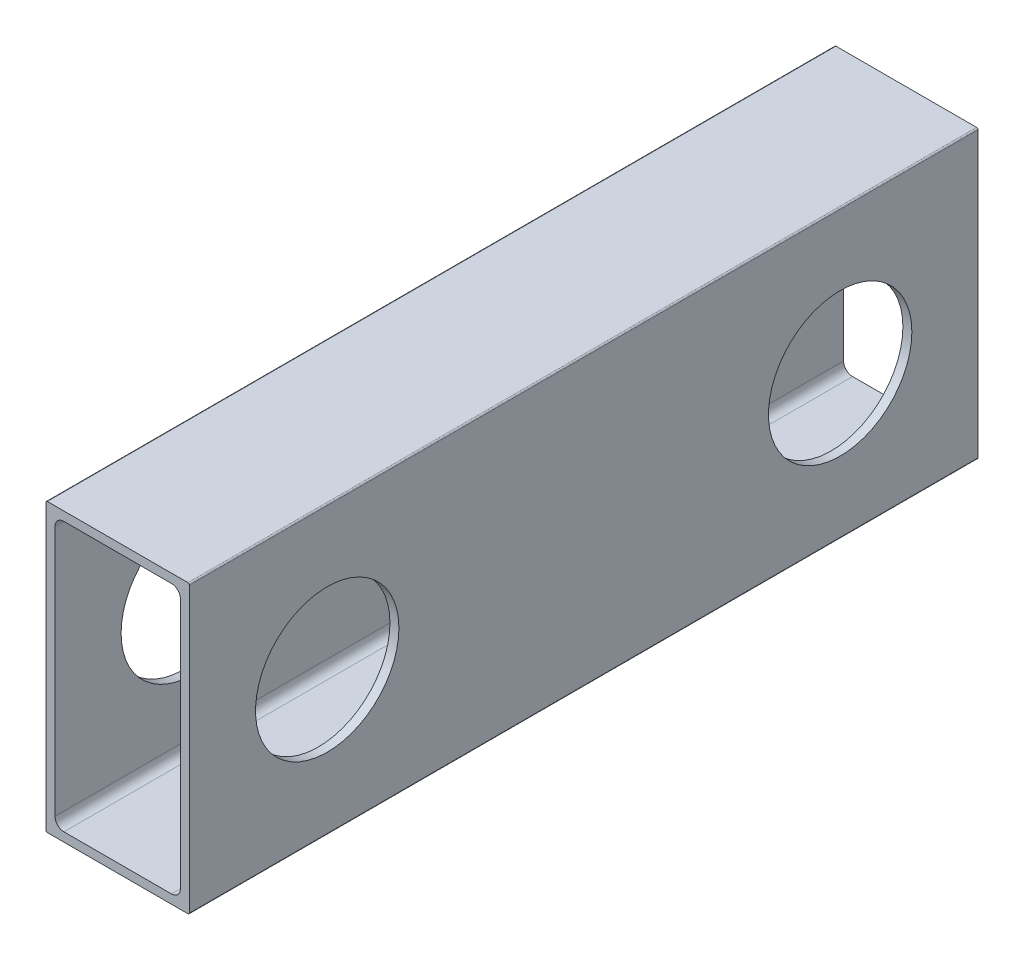
ISO-10303-21;
HEADER;
FILE_DESCRIPTION(('STEP AP214'),'2;1');
FILE_NAME('part.step','',(''),(''),'','','');
FILE_SCHEMA(('AUTOMOTIVE_DESIGN { 1 0 10303 214 1 1 1 1 }'));
ENDSEC;
DATA;
#1=APPLICATION_CONTEXT('core data for automotive mechanical design processes');
#2=APPLICATION_PROTOCOL_DEFINITION('international standard','automotive_design',2000,#1);
#3=PRODUCT_CONTEXT('',#1,'mechanical');
#4=PRODUCT('Part','Part','',(#3));
#5=PRODUCT_RELATED_PRODUCT_CATEGORY('part','',(#4));
#6=PRODUCT_DEFINITION_FORMATION('','',#4);
#7=PRODUCT_DEFINITION_CONTEXT('part definition',#1,'design');
#8=PRODUCT_DEFINITION('design','',#6,#7);
#9=PRODUCT_DEFINITION_SHAPE('','',#8);
#10=(LENGTH_UNIT() NAMED_UNIT(*) SI_UNIT(.MILLI.,.METRE.));
#11=(NAMED_UNIT(*) PLANE_ANGLE_UNIT() SI_UNIT($,.RADIAN.));
#12=(NAMED_UNIT(*) SI_UNIT($,.STERADIAN.) SOLID_ANGLE_UNIT());
#13=UNCERTAINTY_MEASURE_WITH_UNIT(LENGTH_MEASURE(1.E-05),#10,'distance_accuracy_value','');
#14=(GEOMETRIC_REPRESENTATION_CONTEXT(3) GLOBAL_UNCERTAINTY_ASSIGNED_CONTEXT((#13)) GLOBAL_UNIT_ASSIGNED_CONTEXT((#10,
#11,#12)) REPRESENTATION_CONTEXT('',''));
#15=CARTESIAN_POINT('',(0.,0.,0.));
#16=DIRECTION('',(0.,0.,1.));
#17=DIRECTION('',(1.,0.,0.));
#18=AXIS2_PLACEMENT_3D('',#15,#16,#17);
#19=CARTESIAN_POINT('',(12.446,25.146,139.7));
#20=DIRECTION('',(0.,0.,-1.));
#21=DIRECTION('',(-1.,0.,0.));
#22=AXIS2_PLACEMENT_3D('',#19,#20,#21);
#23=CYLINDRICAL_SURFACE('',#22,0.253999999999998);
#24=CARTESIAN_POINT('',(12.446,25.146,0.));
#25=DIRECTION('',(0.,0.,-1.));
#26=DIRECTION('',(-1.,0.,0.));
#27=AXIS2_PLACEMENT_3D('',#24,#25,#26);
#28=CIRCLE('',#27,0.253999999999998);
#29=CARTESIAN_POINT('',(12.446,25.4,0.));
#30=VERTEX_POINT('',#29);
#31=CARTESIAN_POINT('',(12.7,25.146,0.));
#32=VERTEX_POINT('',#31);
#33=EDGE_CURVE('E206',#30,#32,#28,.T.);
#34=ORIENTED_EDGE('',*,*,#33,.F.);
#35=DIRECTION('',(0.,0.,-1.));
#36=VECTOR('',#35,1.);
#37=CARTESIAN_POINT('',(12.446,25.4,139.7));
#38=LINE('',#37,#36);
#39=CARTESIAN_POINT('',(12.446,25.4,139.7));
#40=VERTEX_POINT('',#39);
#41=EDGE_CURVE('E11',#40,#30,#38,.T.);
#42=ORIENTED_EDGE('',*,*,#41,.F.);
#43=CARTESIAN_POINT('',(12.446,25.146,139.7));
#44=DIRECTION('',(0.,0.,-1.));
#45=DIRECTION('',(-1.,0.,0.));
#46=AXIS2_PLACEMENT_3D('',#43,#44,#45);
#47=CIRCLE('',#46,0.253999999999998);
#48=CARTESIAN_POINT('',(12.7,25.146,139.7));
#49=VERTEX_POINT('',#48);
#50=EDGE_CURVE('E218',#40,#49,#47,.T.);
#51=ORIENTED_EDGE('',*,*,#50,.T.);
#52=DIRECTION('',(0.,0.,-1.));
#53=VECTOR('',#52,1.);
#54=CARTESIAN_POINT('',(12.7,25.146,139.7));
#55=LINE('',#54,#53);
#56=EDGE_CURVE('E243',#49,#32,#55,.T.);
#57=ORIENTED_EDGE('',*,*,#56,.T.);
#58=EDGE_LOOP('',(#34,#42,#51,#57));
#59=FACE_BOUND('',#58,.T.);
#60=ADVANCED_FACE('F33',(#59),#23,.T.);
#61=CARTESIAN_POINT('',(-12.446,25.4,139.7));
#62=DIRECTION('',(0.,1.,0.));
#63=DIRECTION('',(0.,0.,1.));
#64=AXIS2_PLACEMENT_3D('',#61,#62,#63);
#65=PLANE('',#64);
#66=DIRECTION('',(1.,0.,0.));
#67=VECTOR('',#66,1.);
#68=CARTESIAN_POINT('',(-12.446,25.4,0.));
#69=LINE('',#68,#67);
#70=CARTESIAN_POINT('',(-12.446,25.4,0.));
#71=VERTEX_POINT('',#70);
#72=EDGE_CURVE('E222',#71,#30,#69,.T.);
#73=ORIENTED_EDGE('',*,*,#72,.F.);
#74=DIRECTION('',(0.,0.,-1.));
#75=VECTOR('',#74,1.);
#76=CARTESIAN_POINT('',(-12.446,25.4,139.7));
#77=LINE('',#76,#75);
#78=CARTESIAN_POINT('',(-12.446,25.4,139.7));
#79=VERTEX_POINT('',#78);
#80=EDGE_CURVE('E41',#79,#71,#77,.T.);
#81=ORIENTED_EDGE('',*,*,#80,.F.);
#82=DIRECTION('',(1.,0.,0.));
#83=VECTOR('',#82,1.);
#84=CARTESIAN_POINT('',(-12.446,25.4,139.7));
#85=LINE('',#84,#83);
#86=EDGE_CURVE('E240',#79,#40,#85,.T.);
#87=ORIENTED_EDGE('',*,*,#86,.T.);
#88=ORIENTED_EDGE('',*,*,#41,.T.);
#89=EDGE_LOOP('',(#73,#81,#87,#88));
#90=FACE_BOUND('',#89,.T.);
#91=ADVANCED_FACE('F320',(#90),#65,.T.);
#92=CARTESIAN_POINT('',(-12.446,25.146,139.7));
#93=DIRECTION('',(0.,0.,-1.));
#94=DIRECTION('',(-1.,0.,0.));
#95=AXIS2_PLACEMENT_3D('',#92,#93,#94);
#96=CYLINDRICAL_SURFACE('',#95,0.253999999999998);
#97=CARTESIAN_POINT('',(-12.446,25.146,0.));
#98=DIRECTION('',(0.,0.,-1.));
#99=DIRECTION('',(-1.,0.,0.));
#100=AXIS2_PLACEMENT_3D('',#97,#98,#99);
#101=CIRCLE('',#100,0.253999999999998);
#102=CARTESIAN_POINT('',(-12.7,25.146,0.));
#103=VERTEX_POINT('',#102);
#104=EDGE_CURVE('E261',#103,#71,#101,.T.);
#105=ORIENTED_EDGE('',*,*,#104,.F.);
#106=DIRECTION('',(0.,0.,-1.));
#107=VECTOR('',#106,1.);
#108=CARTESIAN_POINT('',(-12.7,25.146,139.7));
#109=LINE('',#108,#107);
#110=CARTESIAN_POINT('',(-12.7,25.146,139.7));
#111=VERTEX_POINT('',#110);
#112=EDGE_CURVE('E267',#111,#103,#109,.T.);
#113=ORIENTED_EDGE('',*,*,#112,.F.);
#114=CARTESIAN_POINT('',(-12.446,25.146,139.7));
#115=DIRECTION('',(0.,0.,-1.));
#116=DIRECTION('',(-1.,0.,0.));
#117=AXIS2_PLACEMENT_3D('',#114,#115,#116);
#118=CIRCLE('',#117,0.253999999999998);
#119=EDGE_CURVE('E237',#111,#79,#118,.T.);
#120=ORIENTED_EDGE('',*,*,#119,.T.);
#121=ORIENTED_EDGE('',*,*,#80,.T.);
#122=EDGE_LOOP('',(#105,#113,#120,#121));
#123=FACE_BOUND('',#122,.T.);
#124=ADVANCED_FACE('F323',(#123),#96,.T.);
#125=CARTESIAN_POINT('',(-12.7,-25.146,139.7));
#126=DIRECTION('',(-1.,0.,0.));
#127=DIRECTION('',(0.,0.,1.));
#128=AXIS2_PLACEMENT_3D('',#125,#126,#127);
#129=PLANE('',#128);
#130=CARTESIAN_POINT('',(-12.7,0.,115.282472));
#131=DIRECTION('',(1.,0.,0.));
#132=DIRECTION('',(0.,0.,-1.));
#133=AXIS2_PLACEMENT_3D('',#130,#131,#132);
#134=CIRCLE('',#133,12.7);
#135=CARTESIAN_POINT('',(-12.7,0.,102.582472));
#136=VERTEX_POINT('',#135);
#137=EDGE_CURVE('E280',#136,#136,#134,.T.);
#138=ORIENTED_EDGE('',*,*,#137,.T.);
#139=EDGE_LOOP('',(#138));
#140=FACE_BOUND('',#139,.T.);
#141=CARTESIAN_POINT('',(-12.7,0.,24.417528));
#142=DIRECTION('',(1.,0.,0.));
#143=DIRECTION('',(0.,0.,-1.));
#144=AXIS2_PLACEMENT_3D('',#141,#142,#143);
#145=CIRCLE('',#144,12.7);
#146=CARTESIAN_POINT('',(-12.7,0.,11.717528));
#147=VERTEX_POINT('',#146);
#148=EDGE_CURVE('E290',#147,#147,#145,.T.);
#149=ORIENTED_EDGE('',*,*,#148,.T.);
#150=EDGE_LOOP('',(#149));
#151=FACE_BOUND('',#150,.T.);
#152=DIRECTION('',(0.,1.,0.));
#153=VECTOR('',#152,1.);
#154=CARTESIAN_POINT('',(-12.7,-25.146,0.));
#155=LINE('',#154,#153);
#156=CARTESIAN_POINT('',(-12.7,-25.146,0.));
#157=VERTEX_POINT('',#156);
#158=EDGE_CURVE('E258',#157,#103,#155,.T.);
#159=ORIENTED_EDGE('',*,*,#158,.F.);
#160=DIRECTION('',(0.,0.,-1.));
#161=VECTOR('',#160,1.);
#162=CARTESIAN_POINT('',(-12.7,-25.146,139.7));
#163=LINE('',#162,#161);
#164=CARTESIAN_POINT('',(-12.7,-25.146,139.7));
#165=VERTEX_POINT('',#164);
#166=EDGE_CURVE('E269',#165,#157,#163,.T.);
#167=ORIENTED_EDGE('',*,*,#166,.F.);
#168=DIRECTION('',(0.,1.,0.));
#169=VECTOR('',#168,1.);
#170=CARTESIAN_POINT('',(-12.7,-25.146,139.7));
#171=LINE('',#170,#169);
#172=EDGE_CURVE('E234',#165,#111,#171,.T.);
#173=ORIENTED_EDGE('',*,*,#172,.T.);
#174=ORIENTED_EDGE('',*,*,#112,.T.);
#175=EDGE_LOOP('',(#159,#167,#173,#174));
#176=FACE_BOUND('',#175,.T.);
#177=ADVANCED_FACE('F328',(#140,#151,#176),#129,.T.);
#178=CARTESIAN_POINT('',(-12.446,-25.146,139.7));
#179=DIRECTION('',(0.,0.,-1.));
#180=DIRECTION('',(-1.,0.,0.));
#181=AXIS2_PLACEMENT_3D('',#178,#179,#180);
#182=CYLINDRICAL_SURFACE('',#181,0.253999999999998);
#183=CARTESIAN_POINT('',(-12.446,-25.146,0.));
#184=DIRECTION('',(0.,0.,-1.));
#185=DIRECTION('',(-1.,0.,0.));
#186=AXIS2_PLACEMENT_3D('',#183,#184,#185);
#187=CIRCLE('',#186,0.253999999999998);
#188=CARTESIAN_POINT('',(-12.446,-25.4,0.));
#189=VERTEX_POINT('',#188);
#190=EDGE_CURVE('E255',#189,#157,#187,.T.);
#191=ORIENTED_EDGE('',*,*,#190,.F.);
#192=DIRECTION('',(0.,0.,-1.));
#193=VECTOR('',#192,1.);
#194=CARTESIAN_POINT('',(-12.446,-25.4,139.7));
#195=LINE('',#194,#193);
#196=CARTESIAN_POINT('',(-12.446,-25.4,139.7));
#197=VERTEX_POINT('',#196);
#198=EDGE_CURVE('E271',#197,#189,#195,.T.);
#199=ORIENTED_EDGE('',*,*,#198,.F.);
#200=CARTESIAN_POINT('',(-12.446,-25.146,139.7));
#201=DIRECTION('',(0.,0.,-1.));
#202=DIRECTION('',(-1.,0.,0.));
#203=AXIS2_PLACEMENT_3D('',#200,#201,#202);
#204=CIRCLE('',#203,0.253999999999998);
#205=EDGE_CURVE('E231',#197,#165,#204,.T.);
#206=ORIENTED_EDGE('',*,*,#205,.T.);
#207=ORIENTED_EDGE('',*,*,#166,.T.);
#208=EDGE_LOOP('',(#191,#199,#206,#207));
#209=FACE_BOUND('',#208,.T.);
#210=ADVANCED_FACE('F331',(#209),#182,.T.);
#211=CARTESIAN_POINT('',(12.446,-25.4,139.7));
#212=DIRECTION('',(0.,-1.,0.));
#213=DIRECTION('',(0.,0.,-1.));
#214=AXIS2_PLACEMENT_3D('',#211,#212,#213);
#215=PLANE('',#214);
#216=DIRECTION('',(-1.,0.,0.));
#217=VECTOR('',#216,1.);
#218=CARTESIAN_POINT('',(12.446,-25.4,0.));
#219=LINE('',#218,#217);
#220=CARTESIAN_POINT('',(12.446,-25.4,0.));
#221=VERTEX_POINT('',#220);
#222=EDGE_CURVE('E252',#221,#189,#219,.T.);
#223=ORIENTED_EDGE('',*,*,#222,.F.);
#224=DIRECTION('',(0.,0.,-1.));
#225=VECTOR('',#224,1.);
#226=CARTESIAN_POINT('',(12.446,-25.4,139.7));
#227=LINE('',#226,#225);
#228=CARTESIAN_POINT('',(12.446,-25.4,139.7));
#229=VERTEX_POINT('',#228);
#230=EDGE_CURVE('E273',#229,#221,#227,.T.);
#231=ORIENTED_EDGE('',*,*,#230,.F.);
#232=DIRECTION('',(-1.,0.,0.));
#233=VECTOR('',#232,1.);
#234=CARTESIAN_POINT('',(12.446,-25.4,139.7));
#235=LINE('',#234,#233);
#236=EDGE_CURVE('E228',#229,#197,#235,.T.);
#237=ORIENTED_EDGE('',*,*,#236,.T.);
#238=ORIENTED_EDGE('',*,*,#198,.T.);
#239=EDGE_LOOP('',(#223,#231,#237,#238));
#240=FACE_BOUND('',#239,.T.);
#241=ADVANCED_FACE('F335',(#240),#215,.T.);
#242=CARTESIAN_POINT('',(12.446,-25.146,139.7));
#243=DIRECTION('',(0.,0.,-1.));
#244=DIRECTION('',(-1.,0.,0.));
#245=AXIS2_PLACEMENT_3D('',#242,#243,#244);
#246=CYLINDRICAL_SURFACE('',#245,0.253999999999998);
#247=CARTESIAN_POINT('',(12.446,-25.146,0.));
#248=DIRECTION('',(0.,0.,-1.));
#249=DIRECTION('',(-1.,0.,0.));
#250=AXIS2_PLACEMENT_3D('',#247,#248,#249);
#251=CIRCLE('',#250,0.253999999999998);
#252=CARTESIAN_POINT('',(12.7,-25.146,0.));
#253=VERTEX_POINT('',#252);
#254=EDGE_CURVE('E249',#253,#221,#251,.T.);
#255=ORIENTED_EDGE('',*,*,#254,.F.);
#256=DIRECTION('',(0.,0.,-1.));
#257=VECTOR('',#256,1.);
#258=CARTESIAN_POINT('',(12.7,-25.146,139.7));
#259=LINE('',#258,#257);
#260=CARTESIAN_POINT('',(12.7,-25.146,139.7));
#261=VERTEX_POINT('',#260);
#262=EDGE_CURVE('E275',#261,#253,#259,.T.);
#263=ORIENTED_EDGE('',*,*,#262,.F.);
#264=CARTESIAN_POINT('',(12.446,-25.146,139.7));
#265=DIRECTION('',(0.,0.,-1.));
#266=DIRECTION('',(-1.,0.,0.));
#267=AXIS2_PLACEMENT_3D('',#264,#265,#266);
#268=CIRCLE('',#267,0.253999999999998);
#269=EDGE_CURVE('E225',#261,#229,#268,.T.);
#270=ORIENTED_EDGE('',*,*,#269,.T.);
#271=ORIENTED_EDGE('',*,*,#230,.T.);
#272=EDGE_LOOP('',(#255,#263,#270,#271));
#273=FACE_BOUND('',#272,.T.);
#274=ADVANCED_FACE('F305',(#273),#246,.T.);
#275=CARTESIAN_POINT('',(12.7,25.146,139.7));
#276=DIRECTION('',(1.,0.,0.));
#277=DIRECTION('',(0.,0.,-1.));
#278=AXIS2_PLACEMENT_3D('',#275,#276,#277);
#279=PLANE('',#278);
#280=CARTESIAN_POINT('',(12.7,0.,115.282472));
#281=DIRECTION('',(1.,0.,0.));
#282=DIRECTION('',(0.,0.,-1.));
#283=AXIS2_PLACEMENT_3D('',#280,#281,#282);
#284=CIRCLE('',#283,12.7);
#285=CARTESIAN_POINT('',(12.7,0.,102.582472));
#286=VERTEX_POINT('',#285);
#287=EDGE_CURVE('E285',#286,#286,#284,.T.);
#288=ORIENTED_EDGE('',*,*,#287,.F.);
#289=EDGE_LOOP('',(#288));
#290=FACE_BOUND('',#289,.T.);
#291=CARTESIAN_POINT('',(12.7,0.,24.417528));
#292=DIRECTION('',(1.,0.,0.));
#293=DIRECTION('',(0.,0.,-1.));
#294=AXIS2_PLACEMENT_3D('',#291,#292,#293);
#295=CIRCLE('',#294,12.7);
#296=CARTESIAN_POINT('',(12.7,0.,11.717528));
#297=VERTEX_POINT('',#296);
#298=EDGE_CURVE('E295',#297,#297,#295,.T.);
#299=ORIENTED_EDGE('',*,*,#298,.F.);
#300=EDGE_LOOP('',(#299));
#301=FACE_BOUND('',#300,.T.);
#302=DIRECTION('',(0.,-1.,0.));
#303=VECTOR('',#302,1.);
#304=CARTESIAN_POINT('',(12.7,25.146,0.));
#305=LINE('',#304,#303);
#306=EDGE_CURVE('E246',#32,#253,#305,.T.);
#307=ORIENTED_EDGE('',*,*,#306,.F.);
#308=ORIENTED_EDGE('',*,*,#56,.F.);
#309=DIRECTION('',(0.,-1.,0.));
#310=VECTOR('',#309,1.);
#311=CARTESIAN_POINT('',(12.7,25.146,139.7));
#312=LINE('',#311,#310);
#313=EDGE_CURVE('E221',#49,#261,#312,.T.);
#314=ORIENTED_EDGE('',*,*,#313,.T.);
#315=ORIENTED_EDGE('',*,*,#262,.T.);
#316=EDGE_LOOP('',(#307,#308,#314,#315));
#317=FACE_BOUND('',#316,.T.);
#318=ADVANCED_FACE('F302',(#290,#301,#317),#279,.T.);
#319=CARTESIAN_POINT('',(12.446,25.146,139.7));
#320=DIRECTION('',(0.,0.,-1.));
#321=DIRECTION('',(-1.,0.,0.));
#322=AXIS2_PLACEMENT_3D('',#319,#320,#321);
#323=PLANE('',#322);
#324=DIRECTION('',(0.,-1.,0.));
#325=VECTOR('',#324,1.);
#326=CARTESIAN_POINT('',(11.1125,-22.225,139.7));
#327=LINE('',#326,#325);
#328=CARTESIAN_POINT('',(11.1125,22.225,139.7));
#329=VERTEX_POINT('',#328);
#330=CARTESIAN_POINT('',(11.1125,-22.225,139.7));
#331=VERTEX_POINT('',#330);
#332=EDGE_CURVE('E154',#329,#331,#327,.T.);
#333=ORIENTED_EDGE('',*,*,#332,.T.);
#334=CARTESIAN_POINT('',(9.525,-22.225,139.7));
#335=DIRECTION('',(0.,0.,-1.));
#336=DIRECTION('',(1.,0.,0.));
#337=AXIS2_PLACEMENT_3D('',#334,#335,#336);
#338=CIRCLE('',#337,1.5875);
#339=CARTESIAN_POINT('',(9.525,-23.8125,139.7));
#340=VERTEX_POINT('',#339);
#341=EDGE_CURVE('E148',#331,#340,#338,.T.);
#342=ORIENTED_EDGE('',*,*,#341,.T.);
#343=DIRECTION('',(-1.,0.,0.));
#344=VECTOR('',#343,1.);
#345=CARTESIAN_POINT('',(-9.525,-23.8125,139.7));
#346=LINE('',#345,#344);
#347=CARTESIAN_POINT('',(-9.525,-23.8125,139.7));
#348=VERTEX_POINT('',#347);
#349=EDGE_CURVE('E157',#340,#348,#346,.T.);
#350=ORIENTED_EDGE('',*,*,#349,.T.);
#351=CARTESIAN_POINT('',(-9.525,-22.225,139.7));
#352=DIRECTION('',(0.,0.,-1.));
#353=DIRECTION('',(1.,0.,0.));
#354=AXIS2_PLACEMENT_3D('',#351,#352,#353);
#355=CIRCLE('',#354,1.5875);
#356=CARTESIAN_POINT('',(-11.1125,-22.225,139.7));
#357=VERTEX_POINT('',#356);
#358=EDGE_CURVE('E49',#348,#357,#355,.T.);
#359=ORIENTED_EDGE('',*,*,#358,.T.);
#360=DIRECTION('',(0.,1.,0.));
#361=VECTOR('',#360,1.);
#362=CARTESIAN_POINT('',(-11.1125,22.225,139.7));
#363=LINE('',#362,#361);
#364=CARTESIAN_POINT('',(-11.1125,22.225,139.7));
#365=VERTEX_POINT('',#364);
#366=EDGE_CURVE('E175',#357,#365,#363,.T.);
#367=ORIENTED_EDGE('',*,*,#366,.T.);
#368=CARTESIAN_POINT('',(-9.525,22.225,139.7));
#369=DIRECTION('',(0.,0.,-1.));
#370=DIRECTION('',(1.,0.,0.));
#371=AXIS2_PLACEMENT_3D('',#368,#369,#370);
#372=CIRCLE('',#371,1.5875);
#373=CARTESIAN_POINT('',(-9.525,23.8125,139.7));
#374=VERTEX_POINT('',#373);
#375=EDGE_CURVE('E178',#365,#374,#372,.T.);
#376=ORIENTED_EDGE('',*,*,#375,.T.);
#377=DIRECTION('',(1.,0.,0.));
#378=VECTOR('',#377,1.);
#379=CARTESIAN_POINT('',(9.525,23.8125,139.7));
#380=LINE('',#379,#378);
#381=CARTESIAN_POINT('',(9.525,23.8125,139.7));
#382=VERTEX_POINT('',#381);
#383=EDGE_CURVE('E181',#374,#382,#380,.T.);
#384=ORIENTED_EDGE('',*,*,#383,.T.);
#385=CARTESIAN_POINT('',(9.525,22.225,139.7));
#386=DIRECTION('',(0.,0.,-1.));
#387=DIRECTION('',(1.,0.,0.));
#388=AXIS2_PLACEMENT_3D('',#385,#386,#387);
#389=CIRCLE('',#388,1.5875);
#390=EDGE_CURVE('E184',#382,#329,#389,.T.);
#391=ORIENTED_EDGE('',*,*,#390,.T.);
#392=EDGE_LOOP('',(#333,#342,#350,#359,#367,#376,#384,#391));
#393=FACE_BOUND('',#392,.T.);
#394=ORIENTED_EDGE('',*,*,#50,.F.);
#395=ORIENTED_EDGE('',*,*,#86,.F.);
#396=ORIENTED_EDGE('',*,*,#119,.F.);
#397=ORIENTED_EDGE('',*,*,#172,.F.);
#398=ORIENTED_EDGE('',*,*,#205,.F.);
#399=ORIENTED_EDGE('',*,*,#236,.F.);
#400=ORIENTED_EDGE('',*,*,#269,.F.);
#401=ORIENTED_EDGE('',*,*,#313,.F.);
#402=EDGE_LOOP('',(#394,#395,#396,#397,#398,#399,#400,#401));
#403=FACE_BOUND('',#402,.T.);
#404=ADVANCED_FACE('F161',(#393,#403),#323,.F.);
#405=CARTESIAN_POINT('',(12.446,25.146,0.));
#406=DIRECTION('',(0.,0.,-1.));
#407=DIRECTION('',(-1.,0.,0.));
#408=AXIS2_PLACEMENT_3D('',#405,#406,#407);
#409=PLANE('',#408);
#410=CARTESIAN_POINT('',(9.525,-22.225,0.));
#411=DIRECTION('',(0.,0.,-1.));
#412=DIRECTION('',(1.,0.,0.));
#413=AXIS2_PLACEMENT_3D('',#410,#411,#412);
#414=CIRCLE('',#413,1.5875);
#415=CARTESIAN_POINT('',(11.1125,-22.225,0.));
#416=VERTEX_POINT('',#415);
#417=CARTESIAN_POINT('',(9.525,-23.8125,0.));
#418=VERTEX_POINT('',#417);
#419=EDGE_CURVE('E57',#416,#418,#414,.T.);
#420=ORIENTED_EDGE('',*,*,#419,.F.);
#421=DIRECTION('',(0.,-1.,0.));
#422=VECTOR('',#421,1.);
#423=CARTESIAN_POINT('',(11.1125,-22.225,0.));
#424=LINE('',#423,#422);
#425=CARTESIAN_POINT('',(11.1125,22.225,0.));
#426=VERTEX_POINT('',#425);
#427=EDGE_CURVE('E165',#426,#416,#424,.T.);
#428=ORIENTED_EDGE('',*,*,#427,.F.);
#429=CARTESIAN_POINT('',(9.525,22.225,0.));
#430=DIRECTION('',(0.,0.,-1.));
#431=DIRECTION('',(1.,0.,0.));
#432=AXIS2_PLACEMENT_3D('',#429,#430,#431);
#433=CIRCLE('',#432,1.5875);
#434=CARTESIAN_POINT('',(9.525,23.8125,0.));
#435=VERTEX_POINT('',#434);
#436=EDGE_CURVE('E168',#435,#426,#433,.T.);
#437=ORIENTED_EDGE('',*,*,#436,.F.);
#438=DIRECTION('',(1.,0.,0.));
#439=VECTOR('',#438,1.);
#440=CARTESIAN_POINT('',(9.525,23.8125,0.));
#441=LINE('',#440,#439);
#442=CARTESIAN_POINT('',(-9.525,23.8125,0.));
#443=VERTEX_POINT('',#442);
#444=EDGE_CURVE('E199',#443,#435,#441,.T.);
#445=ORIENTED_EDGE('',*,*,#444,.F.);
#446=CARTESIAN_POINT('',(-9.525,22.225,0.));
#447=DIRECTION('',(0.,0.,-1.));
#448=DIRECTION('',(1.,0.,0.));
#449=AXIS2_PLACEMENT_3D('',#446,#447,#448);
#450=CIRCLE('',#449,1.5875);
#451=CARTESIAN_POINT('',(-11.1125,22.225,0.));
#452=VERTEX_POINT('',#451);
#453=EDGE_CURVE('E196',#452,#443,#450,.T.);
#454=ORIENTED_EDGE('',*,*,#453,.F.);
#455=DIRECTION('',(0.,1.,0.));
#456=VECTOR('',#455,1.);
#457=CARTESIAN_POINT('',(-11.1125,22.225,0.));
#458=LINE('',#457,#456);
#459=CARTESIAN_POINT('',(-11.1125,-22.225,0.));
#460=VERTEX_POINT('',#459);
#461=EDGE_CURVE('E193',#460,#452,#458,.T.);
#462=ORIENTED_EDGE('',*,*,#461,.F.);
#463=CARTESIAN_POINT('',(-9.525,-22.225,0.));
#464=DIRECTION('',(0.,0.,-1.));
#465=DIRECTION('',(1.,0.,0.));
#466=AXIS2_PLACEMENT_3D('',#463,#464,#465);
#467=CIRCLE('',#466,1.5875);
#468=CARTESIAN_POINT('',(-9.525,-23.8125,0.));
#469=VERTEX_POINT('',#468);
#470=EDGE_CURVE('E190',#469,#460,#467,.T.);
#471=ORIENTED_EDGE('',*,*,#470,.F.);
#472=DIRECTION('',(-1.,0.,0.));
#473=VECTOR('',#472,1.);
#474=CARTESIAN_POINT('',(-9.525,-23.8125,0.));
#475=LINE('',#474,#473);
#476=EDGE_CURVE('E188',#418,#469,#475,.T.);
#477=ORIENTED_EDGE('',*,*,#476,.F.);
#478=EDGE_LOOP('',(#420,#428,#437,#445,#454,#462,#471,#477));
#479=FACE_BOUND('',#478,.T.);
#480=ORIENTED_EDGE('',*,*,#33,.T.);
#481=ORIENTED_EDGE('',*,*,#306,.T.);
#482=ORIENTED_EDGE('',*,*,#254,.T.);
#483=ORIENTED_EDGE('',*,*,#222,.T.);
#484=ORIENTED_EDGE('',*,*,#190,.T.);
#485=ORIENTED_EDGE('',*,*,#158,.T.);
#486=ORIENTED_EDGE('',*,*,#104,.T.);
#487=ORIENTED_EDGE('',*,*,#72,.T.);
#488=EDGE_LOOP('',(#480,#481,#482,#483,#484,#485,#486,#487));
#489=FACE_BOUND('',#488,.T.);
#490=ADVANCED_FACE('F312',(#479,#489),#409,.T.);
#491=CARTESIAN_POINT('',(9.525,-22.225,139.7));
#492=DIRECTION('',(0.,0.,-1.));
#493=DIRECTION('',(-1.,0.,0.));
#494=AXIS2_PLACEMENT_3D('',#491,#492,#493);
#495=CYLINDRICAL_SURFACE('',#494,1.5875);
#496=ORIENTED_EDGE('',*,*,#419,.T.);
#497=DIRECTION('',(0.,0.,-1.));
#498=VECTOR('',#497,1.);
#499=CARTESIAN_POINT('',(9.525,-23.8125,139.7));
#500=LINE('',#499,#498);
#501=EDGE_CURVE('E144',#340,#418,#500,.T.);
#502=ORIENTED_EDGE('',*,*,#501,.F.);
#503=ORIENTED_EDGE('',*,*,#341,.F.);
#504=DIRECTION('',(0.,0.,-1.));
#505=VECTOR('',#504,1.);
#506=CARTESIAN_POINT('',(11.1125,-22.225,139.7));
#507=LINE('',#506,#505);
#508=EDGE_CURVE('E204',#331,#416,#507,.T.);
#509=ORIENTED_EDGE('',*,*,#508,.T.);
#510=EDGE_LOOP('',(#496,#502,#503,#509));
#511=FACE_BOUND('',#510,.T.);
#512=ADVANCED_FACE('F146',(#511),#495,.F.);
#513=CARTESIAN_POINT('',(11.1125,-22.225,139.7));
#514=DIRECTION('',(1.,0.,0.));
#515=DIRECTION('',(0.,0.,-1.));
#516=AXIS2_PLACEMENT_3D('',#513,#514,#515);
#517=PLANE('',#516);
#518=CARTESIAN_POINT('',(11.1125,0.,115.282472));
#519=DIRECTION('',(1.,0.,0.));
#520=DIRECTION('',(0.,0.,-1.));
#521=AXIS2_PLACEMENT_3D('',#518,#519,#520);
#522=CIRCLE('',#521,12.7);
#523=CARTESIAN_POINT('',(11.1125,0.,102.582472));
#524=VERTEX_POINT('',#523);
#525=EDGE_CURVE('E171',#524,#524,#522,.T.);
#526=ORIENTED_EDGE('',*,*,#525,.T.);
#527=EDGE_LOOP('',(#526));
#528=FACE_BOUND('',#527,.T.);
#529=CARTESIAN_POINT('',(11.1125,0.,24.417528));
#530=DIRECTION('',(1.,0.,0.));
#531=DIRECTION('',(0.,0.,-1.));
#532=AXIS2_PLACEMENT_3D('',#529,#530,#531);
#533=CIRCLE('',#532,12.7);
#534=CARTESIAN_POINT('',(11.1125,0.,11.717528));
#535=VERTEX_POINT('',#534);
#536=EDGE_CURVE('E279',#535,#535,#533,.T.);
#537=ORIENTED_EDGE('',*,*,#536,.T.);
#538=EDGE_LOOP('',(#537));
#539=FACE_BOUND('',#538,.T.);
#540=ORIENTED_EDGE('',*,*,#427,.T.);
#541=ORIENTED_EDGE('',*,*,#508,.F.);
#542=ORIENTED_EDGE('',*,*,#332,.F.);
#543=DIRECTION('',(0.,0.,-1.));
#544=VECTOR('',#543,1.);
#545=CARTESIAN_POINT('',(11.1125,22.225,139.7));
#546=LINE('',#545,#544);
#547=EDGE_CURVE('E207',#329,#426,#546,.T.);
#548=ORIENTED_EDGE('',*,*,#547,.T.);
#549=EDGE_LOOP('',(#540,#541,#542,#548));
#550=FACE_BOUND('',#549,.T.);
#551=ADVANCED_FACE('F396',(#528,#539,#550),#517,.F.);
#552=CARTESIAN_POINT('',(9.525,22.225,139.7));
#553=DIRECTION('',(0.,0.,-1.));
#554=DIRECTION('',(-1.,0.,0.));
#555=AXIS2_PLACEMENT_3D('',#552,#553,#554);
#556=CYLINDRICAL_SURFACE('',#555,1.5875);
#557=ORIENTED_EDGE('',*,*,#436,.T.);
#558=ORIENTED_EDGE('',*,*,#547,.F.);
#559=ORIENTED_EDGE('',*,*,#390,.F.);
#560=DIRECTION('',(0.,0.,-1.));
#561=VECTOR('',#560,1.);
#562=CARTESIAN_POINT('',(9.525,23.8125,139.7));
#563=LINE('',#562,#561);
#564=EDGE_CURVE('E209',#382,#435,#563,.T.);
#565=ORIENTED_EDGE('',*,*,#564,.T.);
#566=EDGE_LOOP('',(#557,#558,#559,#565));
#567=FACE_BOUND('',#566,.T.);
#568=ADVANCED_FACE('F403',(#567),#556,.F.);
#569=CARTESIAN_POINT('',(9.525,23.8125,139.7));
#570=DIRECTION('',(0.,1.,0.));
#571=DIRECTION('',(0.,0.,1.));
#572=AXIS2_PLACEMENT_3D('',#569,#570,#571);
#573=PLANE('',#572);
#574=ORIENTED_EDGE('',*,*,#444,.T.);
#575=ORIENTED_EDGE('',*,*,#564,.F.);
#576=ORIENTED_EDGE('',*,*,#383,.F.);
#577=DIRECTION('',(0.,0.,-1.));
#578=VECTOR('',#577,1.);
#579=CARTESIAN_POINT('',(-9.525,23.8125,139.7));
#580=LINE('',#579,#578);
#581=EDGE_CURVE('E211',#374,#443,#580,.T.);
#582=ORIENTED_EDGE('',*,*,#581,.T.);
#583=EDGE_LOOP('',(#574,#575,#576,#582));
#584=FACE_BOUND('',#583,.T.);
#585=ADVANCED_FACE('F408',(#584),#573,.F.);
#586=CARTESIAN_POINT('',(-9.525,22.225,139.7));
#587=DIRECTION('',(0.,0.,-1.));
#588=DIRECTION('',(-1.,0.,0.));
#589=AXIS2_PLACEMENT_3D('',#586,#587,#588);
#590=CYLINDRICAL_SURFACE('',#589,1.5875);
#591=ORIENTED_EDGE('',*,*,#453,.T.);
#592=ORIENTED_EDGE('',*,*,#581,.F.);
#593=ORIENTED_EDGE('',*,*,#375,.F.);
#594=DIRECTION('',(0.,0.,-1.));
#595=VECTOR('',#594,1.);
#596=CARTESIAN_POINT('',(-11.1125,22.225,139.7));
#597=LINE('',#596,#595);
#598=EDGE_CURVE('E213',#365,#452,#597,.T.);
#599=ORIENTED_EDGE('',*,*,#598,.T.);
#600=EDGE_LOOP('',(#591,#592,#593,#599));
#601=FACE_BOUND('',#600,.T.);
#602=ADVANCED_FACE('F418',(#601),#590,.F.);
#603=CARTESIAN_POINT('',(-11.1125,22.225,139.7));
#604=DIRECTION('',(-1.,0.,0.));
#605=DIRECTION('',(0.,0.,1.));
#606=AXIS2_PLACEMENT_3D('',#603,#604,#605);
#607=PLANE('',#606);
#608=CARTESIAN_POINT('',(-11.1125,0.,115.282472));
#609=DIRECTION('',(-1.,0.,0.));
#610=DIRECTION('',(0.,0.,1.));
#611=AXIS2_PLACEMENT_3D('',#608,#609,#610);
#612=CIRCLE('',#611,12.7);
#613=CARTESIAN_POINT('',(-11.1125,0.,127.982472));
#614=VERTEX_POINT('',#613);
#615=EDGE_CURVE('E36',#614,#614,#612,.T.);
#616=ORIENTED_EDGE('',*,*,#615,.T.);
#617=EDGE_LOOP('',(#616));
#618=FACE_BOUND('',#617,.T.);
#619=CARTESIAN_POINT('',(-11.1125,0.,24.417528));
#620=DIRECTION('',(-1.,0.,0.));
#621=DIRECTION('',(0.,0.,1.));
#622=AXIS2_PLACEMENT_3D('',#619,#620,#621);
#623=CIRCLE('',#622,12.7);
#624=CARTESIAN_POINT('',(-11.1125,0.,37.117528));
#625=VERTEX_POINT('',#624);
#626=EDGE_CURVE('E277',#625,#625,#623,.T.);
#627=ORIENTED_EDGE('',*,*,#626,.T.);
#628=EDGE_LOOP('',(#627));
#629=FACE_BOUND('',#628,.T.);
#630=ORIENTED_EDGE('',*,*,#461,.T.);
#631=ORIENTED_EDGE('',*,*,#598,.F.);
#632=ORIENTED_EDGE('',*,*,#366,.F.);
#633=DIRECTION('',(0.,0.,-1.));
#634=VECTOR('',#633,1.);
#635=CARTESIAN_POINT('',(-11.1125,-22.225,139.7));
#636=LINE('',#635,#634);
#637=EDGE_CURVE('E215',#357,#460,#636,.T.);
#638=ORIENTED_EDGE('',*,*,#637,.T.);
#639=EDGE_LOOP('',(#630,#631,#632,#638));
#640=FACE_BOUND('',#639,.T.);
#641=ADVANCED_FACE('F428',(#618,#629,#640),#607,.F.);
#642=CARTESIAN_POINT('',(-9.525,-22.225,139.7));
#643=DIRECTION('',(0.,0.,-1.));
#644=DIRECTION('',(-1.,0.,0.));
#645=AXIS2_PLACEMENT_3D('',#642,#643,#644);
#646=CYLINDRICAL_SURFACE('',#645,1.5875);
#647=ORIENTED_EDGE('',*,*,#470,.T.);
#648=ORIENTED_EDGE('',*,*,#637,.F.);
#649=ORIENTED_EDGE('',*,*,#358,.F.);
#650=DIRECTION('',(0.,0.,-1.));
#651=VECTOR('',#650,1.);
#652=CARTESIAN_POINT('',(-9.525,-23.8125,139.7));
#653=LINE('',#652,#651);
#654=EDGE_CURVE('E153',#348,#469,#653,.T.);
#655=ORIENTED_EDGE('',*,*,#654,.T.);
#656=EDGE_LOOP('',(#647,#648,#649,#655));
#657=FACE_BOUND('',#656,.T.);
#658=ADVANCED_FACE('F436',(#657),#646,.F.);
#659=CARTESIAN_POINT('',(-9.525,-23.8125,139.7));
#660=DIRECTION('',(0.,-1.,0.));
#661=DIRECTION('',(0.,0.,-1.));
#662=AXIS2_PLACEMENT_3D('',#659,#660,#661);
#663=PLANE('',#662);
#664=ORIENTED_EDGE('',*,*,#476,.T.);
#665=ORIENTED_EDGE('',*,*,#654,.F.);
#666=ORIENTED_EDGE('',*,*,#349,.F.);
#667=ORIENTED_EDGE('',*,*,#501,.T.);
#668=EDGE_LOOP('',(#664,#665,#666,#667));
#669=FACE_BOUND('',#668,.T.);
#670=ADVANCED_FACE('F158',(#669),#663,.F.);
#671=CARTESIAN_POINT('',(-12.7,0.,24.417528));
#672=DIRECTION('',(1.,0.,0.));
#673=DIRECTION('',(0.,0.,-1.));
#674=AXIS2_PLACEMENT_3D('',#671,#672,#673);
#675=CYLINDRICAL_SURFACE('',#674,12.7);
#676=ORIENTED_EDGE('',*,*,#148,.F.);
#677=EDGE_LOOP('',(#676));
#678=FACE_BOUND('',#677,.T.);
#679=ORIENTED_EDGE('',*,*,#626,.F.);
#680=EDGE_LOOP('',(#679));
#681=FACE_BOUND('',#680,.T.);
#682=ADVANCED_FACE('F448',(#678,#681),#675,.F.);
#683=CARTESIAN_POINT('',(-12.7,0.,115.282472));
#684=DIRECTION('',(1.,0.,0.));
#685=DIRECTION('',(0.,0.,-1.));
#686=AXIS2_PLACEMENT_3D('',#683,#684,#685);
#687=CYLINDRICAL_SURFACE('',#686,12.7);
#688=ORIENTED_EDGE('',*,*,#137,.F.);
#689=EDGE_LOOP('',(#688));
#690=FACE_BOUND('',#689,.T.);
#691=ORIENTED_EDGE('',*,*,#615,.F.);
#692=EDGE_LOOP('',(#691));
#693=FACE_BOUND('',#692,.T.);
#694=ADVANCED_FACE('F482',(#690,#693),#687,.F.);
#695=ORIENTED_EDGE('',*,*,#298,.T.);
#696=EDGE_LOOP('',(#695));
#697=FACE_BOUND('',#696,.T.);
#698=ORIENTED_EDGE('',*,*,#536,.F.);
#699=EDGE_LOOP('',(#698));
#700=FACE_BOUND('',#699,.T.);
#701=ADVANCED_FACE('F299',(#697,#700),#675,.F.);
#702=ORIENTED_EDGE('',*,*,#287,.T.);
#703=EDGE_LOOP('',(#702));
#704=FACE_BOUND('',#703,.T.);
#705=ORIENTED_EDGE('',*,*,#525,.F.);
#706=EDGE_LOOP('',(#705));
#707=FACE_BOUND('',#706,.T.);
#708=ADVANCED_FACE('F494',(#704,#707),#687,.F.);
#709=CLOSED_SHELL('',(#60,#91,#124,#177,#210,#241,#274,#318,#404,#490,#512,#551,#568,#585,#602,
#641,#658,#670,#682,#694,#701,#708));
#710=MANIFOLD_SOLID_BREP('B2',#709);
#711=ADVANCED_BREP_SHAPE_REPRESENTATION('',(#18,#710),#14);
#712=SHAPE_DEFINITION_REPRESENTATION(#9,#711);
ENDSEC;
END-ISO-10303-21;
